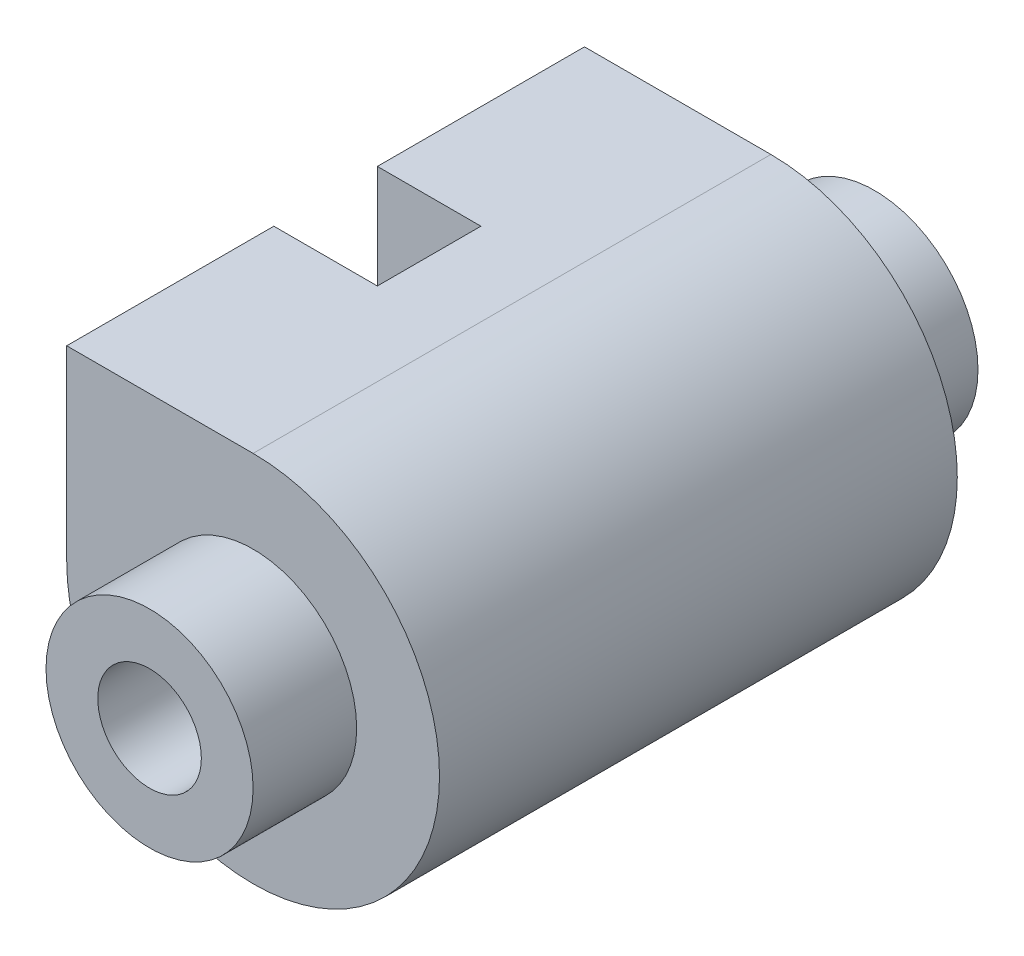
ISO-10303-21;
HEADER;
FILE_DESCRIPTION(('STEP AP214'),'2;1');
FILE_NAME('part.step','',(''),(''),'','','');
FILE_SCHEMA(('AUTOMOTIVE_DESIGN { 1 0 10303 214 1 1 1 1 }'));
ENDSEC;
DATA;
#1=APPLICATION_CONTEXT('core data for automotive mechanical design processes');
#2=APPLICATION_PROTOCOL_DEFINITION('international standard','automotive_design',2000,#1);
#3=PRODUCT_CONTEXT('',#1,'mechanical');
#4=PRODUCT('Part','Part','',(#3));
#5=PRODUCT_RELATED_PRODUCT_CATEGORY('part','',(#4));
#6=PRODUCT_DEFINITION_FORMATION('','',#4);
#7=PRODUCT_DEFINITION_CONTEXT('part definition',#1,'design');
#8=PRODUCT_DEFINITION('design','',#6,#7);
#9=PRODUCT_DEFINITION_SHAPE('','',#8);
#10=(LENGTH_UNIT() NAMED_UNIT(*) SI_UNIT(.MILLI.,.METRE.));
#11=(NAMED_UNIT(*) PLANE_ANGLE_UNIT() SI_UNIT($,.RADIAN.));
#12=(NAMED_UNIT(*) SI_UNIT($,.STERADIAN.) SOLID_ANGLE_UNIT());
#13=UNCERTAINTY_MEASURE_WITH_UNIT(LENGTH_MEASURE(1.E-05),#10,'distance_accuracy_value','');
#14=(GEOMETRIC_REPRESENTATION_CONTEXT(3) GLOBAL_UNCERTAINTY_ASSIGNED_CONTEXT((#13)) GLOBAL_UNIT_ASSIGNED_CONTEXT((#10,
#11,#12)) REPRESENTATION_CONTEXT('',''));
#15=CARTESIAN_POINT('',(0.,0.,0.));
#16=DIRECTION('',(0.,0.,1.));
#17=DIRECTION('',(1.,0.,0.));
#18=AXIS2_PLACEMENT_3D('',#15,#16,#17);
#19=CARTESIAN_POINT('',(-3.6,3.6,0.));
#20=DIRECTION('',(-1.,0.,0.));
#21=DIRECTION('',(0.,0.,1.));
#22=AXIS2_PLACEMENT_3D('',#19,#20,#21);
#23=PLANE('',#22);
#24=DIRECTION('',(0.,0.,-1.));
#25=VECTOR('',#24,1.);
#26=CARTESIAN_POINT('',(-3.6,0.923760430703389,4.));
#27=LINE('',#26,#25);
#28=CARTESIAN_POINT('',(-3.6,0.923760430703389,6.));
#29=VERTEX_POINT('',#28);
#30=CARTESIAN_POINT('',(-3.6,0.923760430703389,4.));
#31=VERTEX_POINT('',#30);
#32=EDGE_CURVE('E123',#29,#31,#27,.T.);
#33=ORIENTED_EDGE('',*,*,#32,.T.);
#34=DIRECTION('',(0.,-1.,0.));
#35=VECTOR('',#34,1.);
#36=CARTESIAN_POINT('',(-3.6,4.6,4.));
#37=LINE('',#36,#35);
#38=CARTESIAN_POINT('',(-3.6,3.6,4.));
#39=VERTEX_POINT('',#38);
#40=EDGE_CURVE('E110',#39,#31,#37,.T.);
#41=ORIENTED_EDGE('',*,*,#40,.F.);
#42=DIRECTION('',(0.,0.,1.));
#43=VECTOR('',#42,1.);
#44=CARTESIAN_POINT('',(-3.6,3.6,0.));
#45=LINE('',#44,#43);
#46=CARTESIAN_POINT('',(-3.6,3.6,0.));
#47=VERTEX_POINT('',#46);
#48=EDGE_CURVE('E121',#47,#39,#45,.T.);
#49=ORIENTED_EDGE('',*,*,#48,.F.);
#50=DIRECTION('',(0.,-1.,0.));
#51=VECTOR('',#50,1.);
#52=CARTESIAN_POINT('',(-3.6,3.6,0.));
#53=LINE('',#52,#51);
#54=CARTESIAN_POINT('',(-3.6,0.,0.));
#55=VERTEX_POINT('',#54);
#56=EDGE_CURVE('E134',#47,#55,#53,.T.);
#57=ORIENTED_EDGE('',*,*,#56,.T.);
#58=DIRECTION('',(0.,0.,1.));
#59=VECTOR('',#58,1.);
#60=CARTESIAN_POINT('',(-3.6,0.,0.));
#61=LINE('',#60,#59);
#62=CARTESIAN_POINT('',(-3.6,0.,10.));
#63=VERTEX_POINT('',#62);
#64=EDGE_CURVE('E129',#55,#63,#61,.T.);
#65=ORIENTED_EDGE('',*,*,#64,.T.);
#66=DIRECTION('',(0.,-1.,0.));
#67=VECTOR('',#66,1.);
#68=CARTESIAN_POINT('',(-3.6,3.6,10.));
#69=LINE('',#68,#67);
#70=CARTESIAN_POINT('',(-3.6,3.6,10.));
#71=VERTEX_POINT('',#70);
#72=EDGE_CURVE('E162',#71,#63,#69,.T.);
#73=ORIENTED_EDGE('',*,*,#72,.F.);
#74=CARTESIAN_POINT('',(-3.6,3.6,6.));
#75=VERTEX_POINT('',#74);
#76=EDGE_CURVE('E130',#75,#71,#45,.T.);
#77=ORIENTED_EDGE('',*,*,#76,.F.);
#78=DIRECTION('',(0.,-1.,0.));
#79=VECTOR('',#78,1.);
#80=CARTESIAN_POINT('',(-3.6,4.6,6.));
#81=LINE('',#80,#79);
#82=EDGE_CURVE('E56',#75,#29,#81,.T.);
#83=ORIENTED_EDGE('',*,*,#82,.T.);
#84=EDGE_LOOP('',(#33,#41,#49,#57,#65,#73,#77,#83));
#85=FACE_BOUND('',#84,.T.);
#86=ADVANCED_FACE('F33',(#85),#23,.T.);
#87=CARTESIAN_POINT('',(-1.8,3.6,5.));
#88=DIRECTION('',(0.,1.,0.));
#89=DIRECTION('',(0.,0.,1.));
#90=AXIS2_PLACEMENT_3D('',#87,#88,#89);
#91=PLANE('',#90);
#92=ORIENTED_EDGE('',*,*,#48,.T.);
#93=DIRECTION('',(-1.,0.,0.));
#94=VECTOR('',#93,1.);
#95=CARTESIAN_POINT('',(-3.6,3.6,4.));
#96=LINE('',#95,#94);
#97=CARTESIAN_POINT('',(-1.6,3.6,4.));
#98=VERTEX_POINT('',#97);
#99=EDGE_CURVE('E106',#98,#39,#96,.T.);
#100=ORIENTED_EDGE('',*,*,#99,.F.);
#101=DIRECTION('',(0.,0.,-1.));
#102=VECTOR('',#101,1.);
#103=CARTESIAN_POINT('',(-1.6,3.6,4.));
#104=LINE('',#103,#102);
#105=CARTESIAN_POINT('',(-1.6,3.6,6.));
#106=VERTEX_POINT('',#105);
#107=EDGE_CURVE('E117',#106,#98,#104,.T.);
#108=ORIENTED_EDGE('',*,*,#107,.F.);
#109=DIRECTION('',(1.,0.,0.));
#110=VECTOR('',#109,1.);
#111=CARTESIAN_POINT('',(-3.6,3.6,6.));
#112=LINE('',#111,#110);
#113=EDGE_CURVE('E116',#75,#106,#112,.T.);
#114=ORIENTED_EDGE('',*,*,#113,.F.);
#115=ORIENTED_EDGE('',*,*,#76,.T.);
#116=DIRECTION('',(-1.,0.,0.));
#117=VECTOR('',#116,1.);
#118=CARTESIAN_POINT('',(0.,3.6,10.));
#119=LINE('',#118,#117);
#120=CARTESIAN_POINT('',(0.,3.6,10.));
#121=VERTEX_POINT('',#120);
#122=EDGE_CURVE('E166',#121,#71,#119,.T.);
#123=ORIENTED_EDGE('',*,*,#122,.F.);
#124=DIRECTION('',(0.,0.,1.));
#125=VECTOR('',#124,1.);
#126=CARTESIAN_POINT('',(0.,3.6,0.));
#127=LINE('',#126,#125);
#128=CARTESIAN_POINT('',(0.,3.6,0.));
#129=VERTEX_POINT('',#128);
#130=EDGE_CURVE('E132',#129,#121,#127,.T.);
#131=ORIENTED_EDGE('',*,*,#130,.F.);
#132=DIRECTION('',(-1.,0.,0.));
#133=VECTOR('',#132,1.);
#134=CARTESIAN_POINT('',(0.,3.6,0.));
#135=LINE('',#134,#133);
#136=EDGE_CURVE('E128',#129,#47,#135,.T.);
#137=ORIENTED_EDGE('',*,*,#136,.T.);
#138=EDGE_LOOP('',(#92,#100,#108,#114,#115,#123,#131,#137));
#139=FACE_BOUND('',#138,.T.);
#140=ADVANCED_FACE('F126',(#139),#91,.T.);
#141=CARTESIAN_POINT('',(0.,0.,10.));
#142=DIRECTION('',(0.,0.,-1.));
#143=DIRECTION('',(-1.,0.,0.));
#144=AXIS2_PLACEMENT_3D('',#141,#142,#143);
#145=CYLINDRICAL_SURFACE('',#144,3.6);
#146=CARTESIAN_POINT('',(0.,0.,0.));
#147=DIRECTION('',(0.,0.,1.));
#148=DIRECTION('',(1.,0.,0.));
#149=AXIS2_PLACEMENT_3D('',#146,#147,#148);
#150=CIRCLE('',#149,3.6);
#151=EDGE_CURVE('E150',#55,#129,#150,.T.);
#152=ORIENTED_EDGE('',*,*,#151,.T.);
#153=ORIENTED_EDGE('',*,*,#130,.T.);
#154=CARTESIAN_POINT('',(0.,0.,10.));
#155=DIRECTION('',(0.,0.,1.));
#156=DIRECTION('',(1.,0.,0.));
#157=AXIS2_PLACEMENT_3D('',#154,#155,#156);
#158=CIRCLE('',#157,3.6);
#159=EDGE_CURVE('E41',#63,#121,#158,.T.);
#160=ORIENTED_EDGE('',*,*,#159,.F.);
#161=ORIENTED_EDGE('',*,*,#64,.F.);
#162=EDGE_LOOP('',(#152,#153,#160,#161));
#163=FACE_BOUND('',#162,.T.);
#164=ADVANCED_FACE('F35',(#163),#145,.T.);
#165=CARTESIAN_POINT('',(0.,0.,10.));
#166=DIRECTION('',(0.,0.,1.));
#167=DIRECTION('',(1.,0.,0.));
#168=AXIS2_PLACEMENT_3D('',#165,#166,#167);
#169=PLANE('',#168);
#170=ORIENTED_EDGE('',*,*,#159,.T.);
#171=ORIENTED_EDGE('',*,*,#122,.T.);
#172=ORIENTED_EDGE('',*,*,#72,.T.);
#173=EDGE_LOOP('',(#170,#171,#172));
#174=FACE_BOUND('',#173,.T.);
#175=CARTESIAN_POINT('',(0.,0.,10.));
#176=DIRECTION('',(0.,0.,1.));
#177=DIRECTION('',(1.,0.,0.));
#178=AXIS2_PLACEMENT_3D('',#175,#176,#177);
#179=CIRCLE('',#178,2.);
#180=CARTESIAN_POINT('',(2.,0.,10.));
#181=VERTEX_POINT('',#180);
#182=EDGE_CURVE('E143',#181,#181,#179,.T.);
#183=ORIENTED_EDGE('',*,*,#182,.F.);
#184=EDGE_LOOP('',(#183));
#185=FACE_BOUND('',#184,.T.);
#186=ADVANCED_FACE('F236',(#174,#185),#169,.T.);
#187=CARTESIAN_POINT('',(0.,0.,0.));
#188=DIRECTION('',(0.,0.,1.));
#189=DIRECTION('',(1.,0.,0.));
#190=AXIS2_PLACEMENT_3D('',#187,#188,#189);
#191=PLANE('',#190);
#192=CARTESIAN_POINT('',(0.,0.,0.));
#193=DIRECTION('',(0.,0.,1.));
#194=DIRECTION('',(1.,0.,0.));
#195=AXIS2_PLACEMENT_3D('',#192,#193,#194);
#196=CIRCLE('',#195,2.);
#197=CARTESIAN_POINT('',(2.,0.,0.));
#198=VERTEX_POINT('',#197);
#199=EDGE_CURVE('E11',#198,#198,#196,.F.);
#200=ORIENTED_EDGE('',*,*,#199,.F.);
#201=EDGE_LOOP('',(#200));
#202=FACE_BOUND('',#201,.T.);
#203=ORIENTED_EDGE('',*,*,#151,.F.);
#204=ORIENTED_EDGE('',*,*,#56,.F.);
#205=ORIENTED_EDGE('',*,*,#136,.F.);
#206=EDGE_LOOP('',(#203,#204,#205));
#207=FACE_BOUND('',#206,.T.);
#208=ADVANCED_FACE('F161',(#202,#207),#191,.F.);
#209=CARTESIAN_POINT('',(0.,0.,12.));
#210=DIRECTION('',(0.,0.,-1.));
#211=DIRECTION('',(-1.,0.,0.));
#212=AXIS2_PLACEMENT_3D('',#209,#210,#211);
#213=CYLINDRICAL_SURFACE('',#212,1.);
#214=DIRECTION('',(0.,0.,1.));
#215=VECTOR('',#214,1.);
#216=CARTESIAN_POINT('',(-0.499999999999999,-0.86602540378444,4.));
#217=LINE('',#216,#215);
#218=CARTESIAN_POINT('',(-0.499999999999998,-0.86602540378444,4.));
#219=VERTEX_POINT('',#218);
#220=CARTESIAN_POINT('',(-0.499999999999999,-0.866025403784439,6.));
#221=VERTEX_POINT('',#220);
#222=EDGE_CURVE('E191',#219,#221,#217,.T.);
#223=ORIENTED_EDGE('',*,*,#222,.T.);
#224=CARTESIAN_POINT('',(0.,0.,6.));
#225=DIRECTION('',(0.,0.,-1.));
#226=DIRECTION('',(-1.,0.,0.));
#227=AXIS2_PLACEMENT_3D('',#224,#225,#226);
#228=CIRCLE('',#227,1.);
#229=CARTESIAN_POINT('',(0.499999999999997,0.866025403784441,6.));
#230=VERTEX_POINT('',#229);
#231=EDGE_CURVE('E169',#221,#230,#228,.T.);
#232=ORIENTED_EDGE('',*,*,#231,.T.);
#233=DIRECTION('',(0.,0.,-1.));
#234=VECTOR('',#233,1.);
#235=CARTESIAN_POINT('',(0.499999999999996,0.86602540378444,4.));
#236=LINE('',#235,#234);
#237=CARTESIAN_POINT('',(0.499999999999996,0.866025403784441,4.));
#238=VERTEX_POINT('',#237);
#239=EDGE_CURVE('E198',#230,#238,#236,.T.);
#240=ORIENTED_EDGE('',*,*,#239,.T.);
#241=CARTESIAN_POINT('',(0.,0.,4.));
#242=DIRECTION('',(0.,0.,1.));
#243=DIRECTION('',(1.,0.,0.));
#244=AXIS2_PLACEMENT_3D('',#241,#242,#243);
#245=CIRCLE('',#244,1.);
#246=EDGE_CURVE('E175',#238,#219,#245,.T.);
#247=ORIENTED_EDGE('',*,*,#246,.T.);
#248=EDGE_LOOP('',(#223,#232,#240,#247));
#249=FACE_BOUND('',#248,.T.);
#250=CARTESIAN_POINT('',(0.,0.,12.));
#251=DIRECTION('',(0.,0.,1.));
#252=DIRECTION('',(1.,0.,0.));
#253=AXIS2_PLACEMENT_3D('',#250,#251,#252);
#254=CIRCLE('',#253,1.);
#255=CARTESIAN_POINT('',(1.,0.,12.));
#256=VERTEX_POINT('',#255);
#257=EDGE_CURVE('E144',#256,#256,#254,.T.);
#258=ORIENTED_EDGE('',*,*,#257,.T.);
#259=EDGE_LOOP('',(#258));
#260=FACE_BOUND('',#259,.T.);
#261=CARTESIAN_POINT('',(0.,0.,-2.));
#262=DIRECTION('',(0.,0.,1.));
#263=DIRECTION('',(1.,0.,0.));
#264=AXIS2_PLACEMENT_3D('',#261,#262,#263);
#265=CIRCLE('',#264,1.);
#266=CARTESIAN_POINT('',(1.,0.,-2.));
#267=VERTEX_POINT('',#266);
#268=EDGE_CURVE('E137',#267,#267,#265,.T.);
#269=ORIENTED_EDGE('',*,*,#268,.F.);
#270=EDGE_LOOP('',(#269));
#271=FACE_BOUND('',#270,.T.);
#272=ADVANCED_FACE('F213',(#249,#260,#271),#213,.F.);
#273=CARTESIAN_POINT('',(0.,0.,12.));
#274=DIRECTION('',(0.,0.,-1.));
#275=DIRECTION('',(-1.,0.,0.));
#276=AXIS2_PLACEMENT_3D('',#273,#274,#275);
#277=CYLINDRICAL_SURFACE('',#276,2.);
#278=CARTESIAN_POINT('',(0.,0.,12.));
#279=DIRECTION('',(0.,0.,1.));
#280=DIRECTION('',(1.,0.,0.));
#281=AXIS2_PLACEMENT_3D('',#278,#279,#280);
#282=CIRCLE('',#281,2.);
#283=CARTESIAN_POINT('',(2.,0.,12.));
#284=VERTEX_POINT('',#283);
#285=EDGE_CURVE('E147',#284,#284,#282,.T.);
#286=ORIENTED_EDGE('',*,*,#285,.F.);
#287=EDGE_LOOP('',(#286));
#288=FACE_BOUND('',#287,.T.);
#289=ORIENTED_EDGE('',*,*,#182,.T.);
#290=EDGE_LOOP('',(#289));
#291=FACE_BOUND('',#290,.T.);
#292=ADVANCED_FACE('F216',(#288,#291),#277,.T.);
#293=CARTESIAN_POINT('',(0.,0.,12.));
#294=DIRECTION('',(0.,0.,1.));
#295=DIRECTION('',(1.,0.,0.));
#296=AXIS2_PLACEMENT_3D('',#293,#294,#295);
#297=PLANE('',#296);
#298=ORIENTED_EDGE('',*,*,#257,.F.);
#299=EDGE_LOOP('',(#298));
#300=FACE_BOUND('',#299,.T.);
#301=ORIENTED_EDGE('',*,*,#285,.T.);
#302=EDGE_LOOP('',(#301));
#303=FACE_BOUND('',#302,.T.);
#304=ADVANCED_FACE('F231',(#300,#303),#297,.T.);
#305=CARTESIAN_POINT('',(0.,0.,-2.));
#306=DIRECTION('',(0.,0.,1.));
#307=DIRECTION('',(1.,0.,0.));
#308=AXIS2_PLACEMENT_3D('',#305,#306,#307);
#309=CYLINDRICAL_SURFACE('',#308,2.);
#310=CARTESIAN_POINT('',(0.,0.,-2.));
#311=DIRECTION('',(0.,0.,-1.));
#312=DIRECTION('',(-1.,0.,0.));
#313=AXIS2_PLACEMENT_3D('',#310,#311,#312);
#314=CIRCLE('',#313,2.);
#315=CARTESIAN_POINT('',(-2.,0.,-2.));
#316=VERTEX_POINT('',#315);
#317=EDGE_CURVE('E140',#316,#316,#314,.T.);
#318=ORIENTED_EDGE('',*,*,#317,.F.);
#319=EDGE_LOOP('',(#318));
#320=FACE_BOUND('',#319,.T.);
#321=ORIENTED_EDGE('',*,*,#199,.T.);
#322=EDGE_LOOP('',(#321));
#323=FACE_BOUND('',#322,.T.);
#324=ADVANCED_FACE('F225',(#320,#323),#309,.T.);
#325=CARTESIAN_POINT('',(0.,0.,-2.));
#326=DIRECTION('',(0.,0.,-1.));
#327=DIRECTION('',(-1.,0.,0.));
#328=AXIS2_PLACEMENT_3D('',#325,#326,#327);
#329=PLANE('',#328);
#330=ORIENTED_EDGE('',*,*,#268,.T.);
#331=EDGE_LOOP('',(#330));
#332=FACE_BOUND('',#331,.T.);
#333=ORIENTED_EDGE('',*,*,#317,.T.);
#334=EDGE_LOOP('',(#333));
#335=FACE_BOUND('',#334,.T.);
#336=ADVANCED_FACE('F222',(#332,#335),#329,.T.);
#337=CARTESIAN_POINT('',(-3.6,4.6,4.));
#338=DIRECTION('',(0.,0.,1.));
#339=DIRECTION('',(1.,0.,0.));
#340=AXIS2_PLACEMENT_3D('',#337,#338,#339);
#341=PLANE('',#340);
#342=ORIENTED_EDGE('',*,*,#99,.T.);
#343=ORIENTED_EDGE('',*,*,#40,.T.);
#344=DIRECTION('',(0.866025403784438,0.500000000000001,0.));
#345=VECTOR('',#344,1.);
#346=CARTESIAN_POINT('',(-2.00814157129578,1.84282032302755,4.));
#347=LINE('',#346,#345);
#348=CARTESIAN_POINT('',(-1.6,2.07846096908264,4.));
#349=VERTEX_POINT('',#348);
#350=EDGE_CURVE('E196',#31,#349,#347,.T.);
#351=ORIENTED_EDGE('',*,*,#350,.T.);
#352=DIRECTION('',(0.,-1.,0.));
#353=VECTOR('',#352,1.);
#354=CARTESIAN_POINT('',(-1.6,4.6,4.));
#355=LINE('',#354,#353);
#356=EDGE_CURVE('E111',#98,#349,#355,.T.);
#357=ORIENTED_EDGE('',*,*,#356,.F.);
#358=EDGE_LOOP('',(#342,#343,#351,#357));
#359=FACE_BOUND('',#358,.T.);
#360=ADVANCED_FACE('F108',(#359),#341,.T.);
#361=CARTESIAN_POINT('',(-1.6,4.6,4.));
#362=DIRECTION('',(-1.,0.,0.));
#363=DIRECTION('',(0.,0.,1.));
#364=AXIS2_PLACEMENT_3D('',#361,#362,#363);
#365=PLANE('',#364);
#366=ORIENTED_EDGE('',*,*,#107,.T.);
#367=ORIENTED_EDGE('',*,*,#356,.T.);
#368=DIRECTION('',(0.,0.,1.));
#369=VECTOR('',#368,1.);
#370=CARTESIAN_POINT('',(-1.6,2.07846096908264,4.));
#371=LINE('',#370,#369);
#372=CARTESIAN_POINT('',(-1.6,2.07846096908264,6.));
#373=VERTEX_POINT('',#372);
#374=EDGE_CURVE('E192',#349,#373,#371,.T.);
#375=ORIENTED_EDGE('',*,*,#374,.T.);
#376=DIRECTION('',(0.,-1.,0.));
#377=VECTOR('',#376,1.);
#378=CARTESIAN_POINT('',(-1.6,4.6,6.));
#379=LINE('',#378,#377);
#380=EDGE_CURVE('E183',#106,#373,#379,.T.);
#381=ORIENTED_EDGE('',*,*,#380,.F.);
#382=EDGE_LOOP('',(#366,#367,#375,#381));
#383=FACE_BOUND('',#382,.T.);
#384=ADVANCED_FACE('F283',(#383),#365,.T.);
#385=CARTESIAN_POINT('',(-3.6,4.6,6.));
#386=DIRECTION('',(0.,0.,-1.));
#387=DIRECTION('',(-1.,0.,0.));
#388=AXIS2_PLACEMENT_3D('',#385,#386,#387);
#389=PLANE('',#388);
#390=ORIENTED_EDGE('',*,*,#113,.T.);
#391=ORIENTED_EDGE('',*,*,#380,.T.);
#392=DIRECTION('',(-0.866025403784438,-0.500000000000001,0.));
#393=VECTOR('',#392,1.);
#394=CARTESIAN_POINT('',(-2.00814157129578,1.84282032302755,6.));
#395=LINE('',#394,#393);
#396=EDGE_CURVE('E188',#373,#29,#395,.T.);
#397=ORIENTED_EDGE('',*,*,#396,.T.);
#398=ORIENTED_EDGE('',*,*,#82,.F.);
#399=EDGE_LOOP('',(#390,#391,#397,#398));
#400=FACE_BOUND('',#399,.T.);
#401=ADVANCED_FACE('F289',(#400),#389,.T.);
#402=CARTESIAN_POINT('',(-3.73660254037844,1.00262794416287,4.));
#403=DIRECTION('',(0.499999999999998,0.86602540378444,0.));
#404=DIRECTION('',(-0.86602540378444,0.499999999999998,0.));
#405=AXIS2_PLACEMENT_3D('',#402,#403,#404);
#406=PLANE('',#405);
#407=ORIENTED_EDGE('',*,*,#32,.F.);
#408=DIRECTION('',(0.86602540378444,-0.499999999999998,0.));
#409=VECTOR('',#408,1.);
#410=CARTESIAN_POINT('',(-3.73660254037844,1.00262794416287,6.));
#411=LINE('',#410,#409);
#412=EDGE_CURVE('E190',#29,#221,#411,.T.);
#413=ORIENTED_EDGE('',*,*,#412,.T.);
#414=ORIENTED_EDGE('',*,*,#222,.F.);
#415=DIRECTION('',(0.86602540378444,-0.499999999999998,0.));
#416=VECTOR('',#415,1.);
#417=CARTESIAN_POINT('',(-3.73660254037844,1.00262794416287,4.));
#418=LINE('',#417,#416);
#419=EDGE_CURVE('E48',#31,#219,#418,.T.);
#420=ORIENTED_EDGE('',*,*,#419,.F.);
#421=EDGE_LOOP('',(#407,#413,#414,#420));
#422=FACE_BOUND('',#421,.T.);
#423=ADVANCED_FACE('F210',(#422),#406,.T.);
#424=CARTESIAN_POINT('',(-3.73660254037844,1.00262794416287,6.));
#425=DIRECTION('',(0.,0.,-1.));
#426=DIRECTION('',(-1.,0.,0.));
#427=AXIS2_PLACEMENT_3D('',#424,#425,#426);
#428=PLANE('',#427);
#429=ORIENTED_EDGE('',*,*,#412,.F.);
#430=ORIENTED_EDGE('',*,*,#396,.F.);
#431=DIRECTION('',(0.86602540378444,-0.499999999999998,0.));
#432=VECTOR('',#431,1.);
#433=CARTESIAN_POINT('',(-2.73660254037845,2.73467875173175,6.));
#434=LINE('',#433,#432);
#435=EDGE_CURVE('E195',#373,#230,#434,.T.);
#436=ORIENTED_EDGE('',*,*,#435,.T.);
#437=ORIENTED_EDGE('',*,*,#231,.F.);
#438=EDGE_LOOP('',(#429,#430,#436,#437));
#439=FACE_BOUND('',#438,.T.);
#440=ADVANCED_FACE('F303',(#439),#428,.T.);
#441=CARTESIAN_POINT('',(-2.73660254037845,2.73467875173175,4.));
#442=DIRECTION('',(-0.499999999999998,-0.86602540378444,0.));
#443=DIRECTION('',(0.86602540378444,-0.499999999999998,0.));
#444=AXIS2_PLACEMENT_3D('',#441,#442,#443);
#445=PLANE('',#444);
#446=ORIENTED_EDGE('',*,*,#374,.F.);
#447=DIRECTION('',(0.86602540378444,-0.499999999999998,0.));
#448=VECTOR('',#447,1.);
#449=CARTESIAN_POINT('',(-2.73660254037845,2.73467875173175,4.));
#450=LINE('',#449,#448);
#451=EDGE_CURVE('E186',#349,#238,#450,.T.);
#452=ORIENTED_EDGE('',*,*,#451,.T.);
#453=ORIENTED_EDGE('',*,*,#239,.F.);
#454=ORIENTED_EDGE('',*,*,#435,.F.);
#455=EDGE_LOOP('',(#446,#452,#453,#454));
#456=FACE_BOUND('',#455,.T.);
#457=ADVANCED_FACE('F310',(#456),#445,.T.);
#458=CARTESIAN_POINT('',(-3.73660254037844,1.00262794416287,4.));
#459=DIRECTION('',(0.,0.,1.));
#460=DIRECTION('',(1.,0.,0.));
#461=AXIS2_PLACEMENT_3D('',#458,#459,#460);
#462=PLANE('',#461);
#463=ORIENTED_EDGE('',*,*,#451,.F.);
#464=ORIENTED_EDGE('',*,*,#350,.F.);
#465=ORIENTED_EDGE('',*,*,#419,.T.);
#466=ORIENTED_EDGE('',*,*,#246,.F.);
#467=EDGE_LOOP('',(#463,#464,#465,#466));
#468=FACE_BOUND('',#467,.T.);
#469=ADVANCED_FACE('F297',(#468),#462,.T.);
#470=CLOSED_SHELL('',(#86,#140,#164,#186,#208,#272,#292,#304,#324,#336,#360,#384,#401,#423,#440,
#457,#469));
#471=MANIFOLD_SOLID_BREP('B2',#470);
#472=ADVANCED_BREP_SHAPE_REPRESENTATION('',(#18,#471),#14);
#473=SHAPE_DEFINITION_REPRESENTATION(#9,#472);
ENDSEC;
END-ISO-10303-21;
